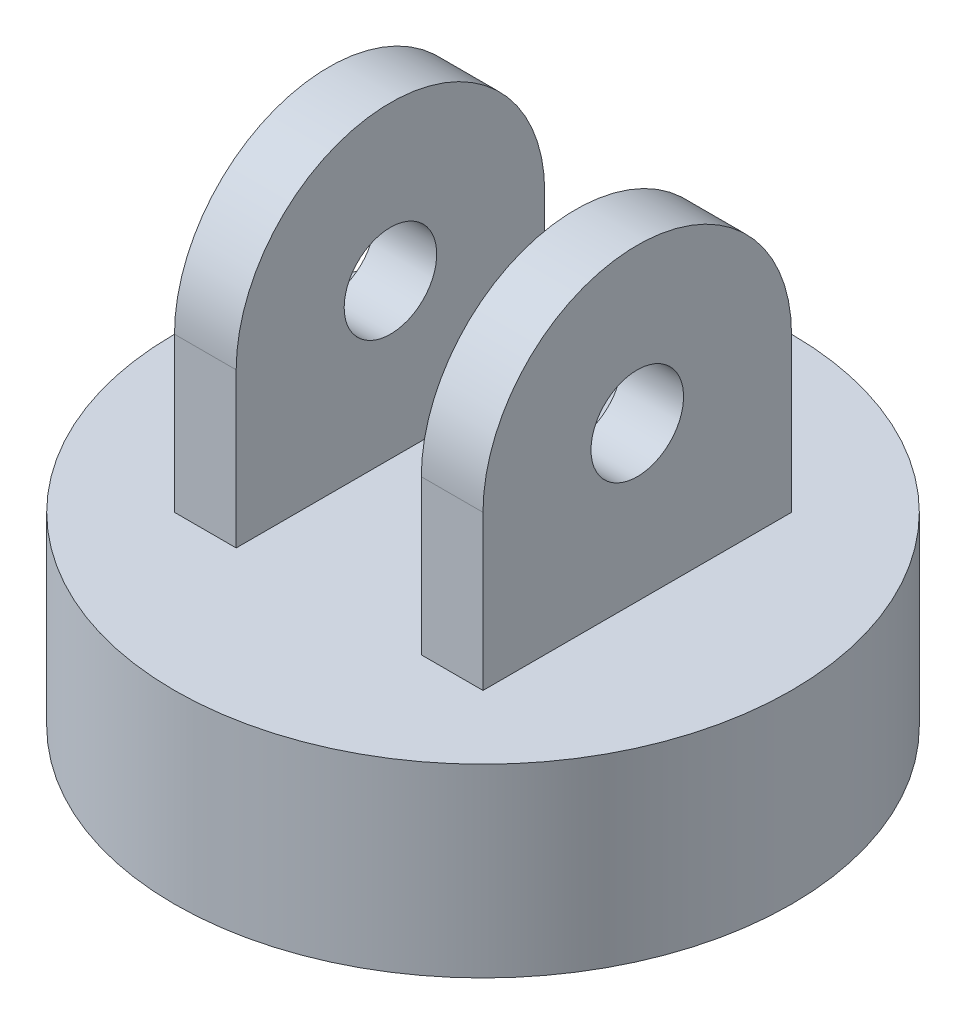
ISO-10303-21;
HEADER;
FILE_DESCRIPTION(('STEP AP214'),'2;1');
FILE_NAME('part.step','',(''),(''),'','','');
FILE_SCHEMA(('AUTOMOTIVE_DESIGN { 1 0 10303 214 1 1 1 1 }'));
ENDSEC;
DATA;
#1=APPLICATION_CONTEXT('core data for automotive mechanical design processes');
#2=APPLICATION_PROTOCOL_DEFINITION('international standard','automotive_design',2000,#1);
#3=PRODUCT_CONTEXT('',#1,'mechanical');
#4=PRODUCT('Part','Part','',(#3));
#5=PRODUCT_RELATED_PRODUCT_CATEGORY('part','',(#4));
#6=PRODUCT_DEFINITION_FORMATION('','',#4);
#7=PRODUCT_DEFINITION_CONTEXT('part definition',#1,'design');
#8=PRODUCT_DEFINITION('design','',#6,#7);
#9=PRODUCT_DEFINITION_SHAPE('','',#8);
#10=(LENGTH_UNIT() NAMED_UNIT(*) SI_UNIT(.MILLI.,.METRE.));
#11=(NAMED_UNIT(*) PLANE_ANGLE_UNIT() SI_UNIT($,.RADIAN.));
#12=(NAMED_UNIT(*) SI_UNIT($,.STERADIAN.) SOLID_ANGLE_UNIT());
#13=UNCERTAINTY_MEASURE_WITH_UNIT(LENGTH_MEASURE(1.E-05),#10,'distance_accuracy_value','');
#14=(GEOMETRIC_REPRESENTATION_CONTEXT(3) GLOBAL_UNCERTAINTY_ASSIGNED_CONTEXT((#13)) GLOBAL_UNIT_ASSIGNED_CONTEXT((#10,
#11,#12)) REPRESENTATION_CONTEXT('',''));
#15=CARTESIAN_POINT('',(0.,0.,0.));
#16=DIRECTION('',(0.,0.,1.));
#17=DIRECTION('',(1.,0.,0.));
#18=AXIS2_PLACEMENT_3D('',#15,#16,#17);
#19=CARTESIAN_POINT('',(15.,80.,25.));
#20=DIRECTION('',(1.,0.,0.));
#21=DIRECTION('',(0.,0.,-1.));
#22=AXIS2_PLACEMENT_3D('',#19,#20,#21);
#23=PLANE('',#22);
#24=CARTESIAN_POINT('',(15.,55.,0.));
#25=DIRECTION('',(1.,0.,0.));
#26=DIRECTION('',(0.,0.,-1.));
#27=AXIS2_PLACEMENT_3D('',#24,#25,#26);
#28=CIRCLE('',#27,7.5);
#29=CARTESIAN_POINT('',(15.,55.,-7.5));
#30=VERTEX_POINT('',#29);
#31=EDGE_CURVE('E237',#30,#30,#28,.T.);
#32=ORIENTED_EDGE('',*,*,#31,.T.);
#33=EDGE_LOOP('',(#32));
#34=FACE_BOUND('',#33,.T.);
#35=DIRECTION('',(0.,-1.,0.));
#36=VECTOR('',#35,1.);
#37=CARTESIAN_POINT('',(15.,80.,25.));
#38=LINE('',#37,#36);
#39=CARTESIAN_POINT('',(15.,55.,25.));
#40=VERTEX_POINT('',#39);
#41=CARTESIAN_POINT('',(15.,30.,25.));
#42=VERTEX_POINT('',#41);
#43=EDGE_CURVE('E132',#40,#42,#38,.T.);
#44=ORIENTED_EDGE('',*,*,#43,.F.);
#45=CARTESIAN_POINT('',(15.,55.,0.));
#46=DIRECTION('',(1.,0.,0.));
#47=DIRECTION('',(0.,0.,-1.));
#48=AXIS2_PLACEMENT_3D('',#45,#46,#47);
#49=CIRCLE('',#48,25.);
#50=CARTESIAN_POINT('',(15.,55.,-25.));
#51=VERTEX_POINT('',#50);
#52=EDGE_CURVE('E203',#40,#51,#49,.F.);
#53=ORIENTED_EDGE('',*,*,#52,.T.);
#54=DIRECTION('',(0.,-1.,0.));
#55=VECTOR('',#54,1.);
#56=CARTESIAN_POINT('',(15.,80.,-25.));
#57=LINE('',#56,#55);
#58=CARTESIAN_POINT('',(15.,30.,-25.));
#59=VERTEX_POINT('',#58);
#60=EDGE_CURVE('E119',#51,#59,#57,.T.);
#61=ORIENTED_EDGE('',*,*,#60,.T.);
#62=DIRECTION('',(0.,0.,1.));
#63=VECTOR('',#62,1.);
#64=CARTESIAN_POINT('',(15.,30.,25.));
#65=LINE('',#64,#63);
#66=EDGE_CURVE('E184',#59,#42,#65,.T.);
#67=ORIENTED_EDGE('',*,*,#66,.T.);
#68=EDGE_LOOP('',(#44,#53,#61,#67));
#69=FACE_BOUND('',#68,.T.);
#70=ADVANCED_FACE('F39',(#34,#69),#23,.F.);
#71=CARTESIAN_POINT('',(25.,80.,25.));
#72=DIRECTION('',(0.,0.,-1.));
#73=DIRECTION('',(-1.,0.,0.));
#74=AXIS2_PLACEMENT_3D('',#71,#72,#73);
#75=PLANE('',#74);
#76=DIRECTION('',(-1.,0.,0.));
#77=VECTOR('',#76,1.);
#78=CARTESIAN_POINT('',(25.,55.,25.));
#79=LINE('',#78,#77);
#80=CARTESIAN_POINT('',(25.,55.,25.));
#81=VERTEX_POINT('',#80);
#82=EDGE_CURVE('E55',#81,#40,#79,.T.);
#83=ORIENTED_EDGE('',*,*,#82,.T.);
#84=ORIENTED_EDGE('',*,*,#43,.T.);
#85=DIRECTION('',(1.,0.,0.));
#86=VECTOR('',#85,1.);
#87=CARTESIAN_POINT('',(25.,30.,25.));
#88=LINE('',#87,#86);
#89=CARTESIAN_POINT('',(25.,30.,25.));
#90=VERTEX_POINT('',#89);
#91=EDGE_CURVE('E134',#42,#90,#88,.T.);
#92=ORIENTED_EDGE('',*,*,#91,.T.);
#93=DIRECTION('',(0.,-1.,0.));
#94=VECTOR('',#93,1.);
#95=CARTESIAN_POINT('',(25.,80.,25.));
#96=LINE('',#95,#94);
#97=EDGE_CURVE('E128',#81,#90,#96,.T.);
#98=ORIENTED_EDGE('',*,*,#97,.F.);
#99=EDGE_LOOP('',(#83,#84,#92,#98));
#100=FACE_BOUND('',#99,.T.);
#101=ADVANCED_FACE('F160',(#100),#75,.F.);
#102=CARTESIAN_POINT('',(25.,80.,25.));
#103=DIRECTION('',(-1.,0.,0.));
#104=DIRECTION('',(0.,0.,1.));
#105=AXIS2_PLACEMENT_3D('',#102,#103,#104);
#106=PLANE('',#105);
#107=CARTESIAN_POINT('',(25.,55.,0.));
#108=DIRECTION('',(-1.,0.,0.));
#109=DIRECTION('',(0.,0.,1.));
#110=AXIS2_PLACEMENT_3D('',#107,#108,#109);
#111=CIRCLE('',#110,7.5);
#112=CARTESIAN_POINT('',(25.,55.,7.5));
#113=VERTEX_POINT('',#112);
#114=EDGE_CURVE('E245',#113,#113,#111,.T.);
#115=ORIENTED_EDGE('',*,*,#114,.T.);
#116=EDGE_LOOP('',(#115));
#117=FACE_BOUND('',#116,.T.);
#118=DIRECTION('',(0.,-1.,0.));
#119=VECTOR('',#118,1.);
#120=CARTESIAN_POINT('',(25.,80.,-25.));
#121=LINE('',#120,#119);
#122=CARTESIAN_POINT('',(25.,55.,-25.));
#123=VERTEX_POINT('',#122);
#124=CARTESIAN_POINT('',(25.,30.,-25.));
#125=VERTEX_POINT('',#124);
#126=EDGE_CURVE('E117',#123,#125,#121,.T.);
#127=ORIENTED_EDGE('',*,*,#126,.F.);
#128=CARTESIAN_POINT('',(25.,55.,0.));
#129=DIRECTION('',(1.,0.,0.));
#130=DIRECTION('',(0.,0.,1.));
#131=AXIS2_PLACEMENT_3D('',#128,#129,#130);
#132=CIRCLE('',#131,25.);
#133=EDGE_CURVE('E103',#123,#81,#132,.T.);
#134=ORIENTED_EDGE('',*,*,#133,.T.);
#135=ORIENTED_EDGE('',*,*,#97,.T.);
#136=DIRECTION('',(0.,0.,-1.));
#137=VECTOR('',#136,1.);
#138=CARTESIAN_POINT('',(25.,30.,25.));
#139=LINE('',#138,#137);
#140=EDGE_CURVE('E125',#90,#125,#139,.T.);
#141=ORIENTED_EDGE('',*,*,#140,.T.);
#142=EDGE_LOOP('',(#127,#134,#135,#141));
#143=FACE_BOUND('',#142,.T.);
#144=ADVANCED_FACE('F123',(#117,#143),#106,.F.);
#145=CARTESIAN_POINT('',(-15.,80.,25.));
#146=DIRECTION('',(0.,0.,-1.));
#147=DIRECTION('',(-1.,0.,0.));
#148=AXIS2_PLACEMENT_3D('',#145,#146,#147);
#149=PLANE('',#148);
#150=CARTESIAN_POINT('',(-15.,55.,25.));
#151=VERTEX_POINT('',#150);
#152=CARTESIAN_POINT('',(-25.,55.,25.));
#153=VERTEX_POINT('',#152);
#154=EDGE_CURVE('E121',#151,#153,#79,.T.);
#155=ORIENTED_EDGE('',*,*,#154,.T.);
#156=DIRECTION('',(0.,-1.,0.));
#157=VECTOR('',#156,1.);
#158=CARTESIAN_POINT('',(-25.,80.,25.));
#159=LINE('',#158,#157);
#160=CARTESIAN_POINT('',(-25.,30.,25.));
#161=VERTEX_POINT('',#160);
#162=EDGE_CURVE('E210',#153,#161,#159,.T.);
#163=ORIENTED_EDGE('',*,*,#162,.T.);
#164=DIRECTION('',(1.,0.,0.));
#165=VECTOR('',#164,1.);
#166=CARTESIAN_POINT('',(-15.,30.,25.));
#167=LINE('',#166,#165);
#168=CARTESIAN_POINT('',(-15.,30.,25.));
#169=VERTEX_POINT('',#168);
#170=EDGE_CURVE('E192',#161,#169,#167,.T.);
#171=ORIENTED_EDGE('',*,*,#170,.T.);
#172=DIRECTION('',(0.,-1.,0.));
#173=VECTOR('',#172,1.);
#174=CARTESIAN_POINT('',(-15.,80.,25.));
#175=LINE('',#174,#173);
#176=EDGE_CURVE('E219',#151,#169,#175,.T.);
#177=ORIENTED_EDGE('',*,*,#176,.F.);
#178=EDGE_LOOP('',(#155,#163,#171,#177));
#179=FACE_BOUND('',#178,.T.);
#180=ADVANCED_FACE('F274',(#179),#149,.F.);
#181=CARTESIAN_POINT('',(-15.,80.,25.));
#182=DIRECTION('',(-1.,0.,0.));
#183=DIRECTION('',(0.,0.,1.));
#184=AXIS2_PLACEMENT_3D('',#181,#182,#183);
#185=PLANE('',#184);
#186=CARTESIAN_POINT('',(-15.,55.,0.));
#187=DIRECTION('',(-1.,0.,0.));
#188=DIRECTION('',(0.,0.,1.));
#189=AXIS2_PLACEMENT_3D('',#186,#187,#188);
#190=CIRCLE('',#189,7.5);
#191=CARTESIAN_POINT('',(-15.,55.,7.5));
#192=VERTEX_POINT('',#191);
#193=EDGE_CURVE('E241',#192,#192,#190,.T.);
#194=ORIENTED_EDGE('',*,*,#193,.T.);
#195=EDGE_LOOP('',(#194));
#196=FACE_BOUND('',#195,.T.);
#197=DIRECTION('',(0.,-1.,0.));
#198=VECTOR('',#197,1.);
#199=CARTESIAN_POINT('',(-15.,80.,-25.));
#200=LINE('',#199,#198);
#201=CARTESIAN_POINT('',(-15.,55.,-25.));
#202=VERTEX_POINT('',#201);
#203=CARTESIAN_POINT('',(-15.,30.,-25.));
#204=VERTEX_POINT('',#203);
#205=EDGE_CURVE('E216',#202,#204,#200,.T.);
#206=ORIENTED_EDGE('',*,*,#205,.F.);
#207=CARTESIAN_POINT('',(-15.,55.,0.));
#208=DIRECTION('',(-1.,0.,0.));
#209=DIRECTION('',(0.,0.,1.));
#210=AXIS2_PLACEMENT_3D('',#207,#208,#209);
#211=CIRCLE('',#210,25.);
#212=EDGE_CURVE('E230',#202,#151,#211,.F.);
#213=ORIENTED_EDGE('',*,*,#212,.T.);
#214=ORIENTED_EDGE('',*,*,#176,.T.);
#215=DIRECTION('',(0.,0.,-1.));
#216=VECTOR('',#215,1.);
#217=CARTESIAN_POINT('',(-15.,30.,25.));
#218=LINE('',#217,#216);
#219=EDGE_CURVE('E189',#169,#204,#218,.T.);
#220=ORIENTED_EDGE('',*,*,#219,.T.);
#221=EDGE_LOOP('',(#206,#213,#214,#220));
#222=FACE_BOUND('',#221,.T.);
#223=ADVANCED_FACE('F176',(#196,#222),#185,.F.);
#224=CARTESIAN_POINT('',(-25.,80.,25.));
#225=DIRECTION('',(1.,0.,0.));
#226=DIRECTION('',(0.,0.,-1.));
#227=AXIS2_PLACEMENT_3D('',#224,#225,#226);
#228=PLANE('',#227);
#229=CARTESIAN_POINT('',(-25.,55.,0.));
#230=DIRECTION('',(-1.,0.,0.));
#231=DIRECTION('',(0.,0.,1.));
#232=AXIS2_PLACEMENT_3D('',#229,#230,#231);
#233=CIRCLE('',#232,7.5);
#234=CARTESIAN_POINT('',(-25.,55.,7.5));
#235=VERTEX_POINT('',#234);
#236=EDGE_CURVE('E246',#235,#235,#233,.T.);
#237=ORIENTED_EDGE('',*,*,#236,.F.);
#238=EDGE_LOOP('',(#237));
#239=FACE_BOUND('',#238,.T.);
#240=ORIENTED_EDGE('',*,*,#162,.F.);
#241=CARTESIAN_POINT('',(-25.,55.,0.));
#242=DIRECTION('',(1.,0.,0.));
#243=DIRECTION('',(0.,0.,1.));
#244=AXIS2_PLACEMENT_3D('',#241,#242,#243);
#245=CIRCLE('',#244,25.);
#246=CARTESIAN_POINT('',(-25.,55.,-25.));
#247=VERTEX_POINT('',#246);
#248=EDGE_CURVE('E63',#247,#153,#245,.T.);
#249=ORIENTED_EDGE('',*,*,#248,.F.);
#250=DIRECTION('',(0.,-1.,0.));
#251=VECTOR('',#250,1.);
#252=CARTESIAN_POINT('',(-25.,80.,-25.));
#253=LINE('',#252,#251);
#254=CARTESIAN_POINT('',(-25.,30.,-25.));
#255=VERTEX_POINT('',#254);
#256=EDGE_CURVE('E213',#247,#255,#253,.T.);
#257=ORIENTED_EDGE('',*,*,#256,.T.);
#258=DIRECTION('',(0.,0.,1.));
#259=VECTOR('',#258,1.);
#260=CARTESIAN_POINT('',(-25.,30.,25.));
#261=LINE('',#260,#259);
#262=EDGE_CURVE('E201',#255,#161,#261,.T.);
#263=ORIENTED_EDGE('',*,*,#262,.T.);
#264=EDGE_LOOP('',(#240,#249,#257,#263));
#265=FACE_BOUND('',#264,.T.);
#266=ADVANCED_FACE('F171',(#239,#265),#228,.F.);
#267=CARTESIAN_POINT('',(0.,30.,0.));
#268=DIRECTION('',(0.,1.,0.));
#269=DIRECTION('',(0.,0.,1.));
#270=AXIS2_PLACEMENT_3D('',#267,#268,#269);
#271=PLANE('',#270);
#272=CARTESIAN_POINT('',(0.,30.,0.));
#273=DIRECTION('',(0.,1.,0.));
#274=DIRECTION('',(0.,0.,1.));
#275=AXIS2_PLACEMENT_3D('',#272,#273,#274);
#276=CIRCLE('',#275,50.);
#277=CARTESIAN_POINT('',(0.,30.,50.));
#278=VERTEX_POINT('',#277);
#279=EDGE_CURVE('E11',#278,#278,#276,.T.);
#280=ORIENTED_EDGE('',*,*,#279,.T.);
#281=EDGE_LOOP('',(#280));
#282=FACE_BOUND('',#281,.T.);
#283=ORIENTED_EDGE('',*,*,#66,.F.);
#284=DIRECTION('',(-1.,0.,0.));
#285=VECTOR('',#284,1.);
#286=CARTESIAN_POINT('',(15.,30.,-25.));
#287=LINE('',#286,#285);
#288=EDGE_CURVE('E222',#125,#59,#287,.T.);
#289=ORIENTED_EDGE('',*,*,#288,.F.);
#290=ORIENTED_EDGE('',*,*,#140,.F.);
#291=ORIENTED_EDGE('',*,*,#91,.F.);
#292=EDGE_LOOP('',(#283,#289,#290,#291));
#293=FACE_BOUND('',#292,.T.);
#294=ORIENTED_EDGE('',*,*,#219,.F.);
#295=ORIENTED_EDGE('',*,*,#170,.F.);
#296=ORIENTED_EDGE('',*,*,#262,.F.);
#297=DIRECTION('',(-1.,0.,0.));
#298=VECTOR('',#297,1.);
#299=CARTESIAN_POINT('',(-25.,30.,-25.));
#300=LINE('',#299,#298);
#301=EDGE_CURVE('E194',#204,#255,#300,.T.);
#302=ORIENTED_EDGE('',*,*,#301,.F.);
#303=EDGE_LOOP('',(#294,#295,#296,#302));
#304=FACE_BOUND('',#303,.T.);
#305=ADVANCED_FACE('F156',(#282,#293,#304),#271,.T.);
#306=CARTESIAN_POINT('',(0.,30.,0.));
#307=DIRECTION('',(0.,-1.,0.));
#308=DIRECTION('',(0.,0.,-1.));
#309=AXIS2_PLACEMENT_3D('',#306,#307,#308);
#310=CYLINDRICAL_SURFACE('',#309,50.);
#311=ORIENTED_EDGE('',*,*,#279,.F.);
#312=EDGE_LOOP('',(#311));
#313=FACE_BOUND('',#312,.T.);
#314=CARTESIAN_POINT('',(0.,0.,0.));
#315=DIRECTION('',(0.,1.,0.));
#316=DIRECTION('',(0.,0.,1.));
#317=AXIS2_PLACEMENT_3D('',#314,#315,#316);
#318=CIRCLE('',#317,50.);
#319=CARTESIAN_POINT('',(0.,0.,50.));
#320=VERTEX_POINT('',#319);
#321=EDGE_CURVE('E43',#320,#320,#318,.T.);
#322=ORIENTED_EDGE('',*,*,#321,.T.);
#323=EDGE_LOOP('',(#322));
#324=FACE_BOUND('',#323,.T.);
#325=ADVANCED_FACE('F41',(#313,#324),#310,.T.);
#326=CARTESIAN_POINT('',(0.,0.,0.));
#327=DIRECTION('',(0.,1.,0.));
#328=DIRECTION('',(0.,0.,1.));
#329=AXIS2_PLACEMENT_3D('',#326,#327,#328);
#330=PLANE('',#329);
#331=ORIENTED_EDGE('',*,*,#321,.F.);
#332=EDGE_LOOP('',(#331));
#333=FACE_BOUND('',#332,.T.);
#334=ADVANCED_FACE('F148',(#333),#330,.F.);
#335=CARTESIAN_POINT('',(15.,80.,-25.));
#336=DIRECTION('',(0.,0.,1.));
#337=DIRECTION('',(1.,0.,0.));
#338=AXIS2_PLACEMENT_3D('',#335,#336,#337);
#339=PLANE('',#338);
#340=ORIENTED_EDGE('',*,*,#60,.F.);
#341=DIRECTION('',(-1.,0.,0.));
#342=VECTOR('',#341,1.);
#343=CARTESIAN_POINT('',(25.,55.,-25.));
#344=LINE('',#343,#342);
#345=EDGE_CURVE('E106',#123,#51,#344,.T.);
#346=ORIENTED_EDGE('',*,*,#345,.F.);
#347=ORIENTED_EDGE('',*,*,#126,.T.);
#348=ORIENTED_EDGE('',*,*,#288,.T.);
#349=EDGE_LOOP('',(#340,#346,#347,#348));
#350=FACE_BOUND('',#349,.T.);
#351=ADVANCED_FACE('F115',(#350),#339,.F.);
#352=CARTESIAN_POINT('',(-25.,80.,-25.));
#353=DIRECTION('',(0.,0.,1.));
#354=DIRECTION('',(1.,0.,0.));
#355=AXIS2_PLACEMENT_3D('',#352,#353,#354);
#356=PLANE('',#355);
#357=ORIENTED_EDGE('',*,*,#256,.F.);
#358=EDGE_CURVE('E112',#202,#247,#344,.T.);
#359=ORIENTED_EDGE('',*,*,#358,.F.);
#360=ORIENTED_EDGE('',*,*,#205,.T.);
#361=ORIENTED_EDGE('',*,*,#301,.T.);
#362=EDGE_LOOP('',(#357,#359,#360,#361));
#363=FACE_BOUND('',#362,.T.);
#364=ADVANCED_FACE('F154',(#363),#356,.F.);
#365=CARTESIAN_POINT('',(25.,55.,0.));
#366=DIRECTION('',(-1.,0.,0.));
#367=DIRECTION('',(0.,0.,1.));
#368=AXIS2_PLACEMENT_3D('',#365,#366,#367);
#369=CYLINDRICAL_SURFACE('',#368,25.);
#370=ORIENTED_EDGE('',*,*,#358,.T.);
#371=ORIENTED_EDGE('',*,*,#248,.T.);
#372=ORIENTED_EDGE('',*,*,#154,.F.);
#373=ORIENTED_EDGE('',*,*,#212,.F.);
#374=EDGE_LOOP('',(#370,#371,#372,#373));
#375=FACE_BOUND('',#374,.T.);
#376=ADVANCED_FACE('F267',(#375),#369,.T.);
#377=ORIENTED_EDGE('',*,*,#82,.F.);
#378=ORIENTED_EDGE('',*,*,#133,.F.);
#379=ORIENTED_EDGE('',*,*,#345,.T.);
#380=ORIENTED_EDGE('',*,*,#52,.F.);
#381=EDGE_LOOP('',(#377,#378,#379,#380));
#382=FACE_BOUND('',#381,.T.);
#383=ADVANCED_FACE('F105',(#382),#369,.T.);
#384=CARTESIAN_POINT('',(25.,55.,0.));
#385=DIRECTION('',(-1.,0.,0.));
#386=DIRECTION('',(0.,0.,1.));
#387=AXIS2_PLACEMENT_3D('',#384,#385,#386);
#388=CYLINDRICAL_SURFACE('',#387,7.5);
#389=ORIENTED_EDGE('',*,*,#236,.T.);
#390=EDGE_LOOP('',(#389));
#391=FACE_BOUND('',#390,.T.);
#392=ORIENTED_EDGE('',*,*,#193,.F.);
#393=EDGE_LOOP('',(#392));
#394=FACE_BOUND('',#393,.T.);
#395=ADVANCED_FACE('F258',(#391,#394),#388,.F.);
#396=ORIENTED_EDGE('',*,*,#114,.F.);
#397=EDGE_LOOP('',(#396));
#398=FACE_BOUND('',#397,.T.);
#399=ORIENTED_EDGE('',*,*,#31,.F.);
#400=EDGE_LOOP('',(#399));
#401=FACE_BOUND('',#400,.T.);
#402=ADVANCED_FACE('F255',(#398,#401),#388,.F.);
#403=CLOSED_SHELL('',(#70,#101,#144,#180,#223,#266,#305,#325,#334,#351,#364,#376,#383,#395,#402));
#404=MANIFOLD_SOLID_BREP('B2',#403);
#405=ADVANCED_BREP_SHAPE_REPRESENTATION('',(#18,#404),#14);
#406=SHAPE_DEFINITION_REPRESENTATION(#9,#405);
ENDSEC;
END-ISO-10303-21;
